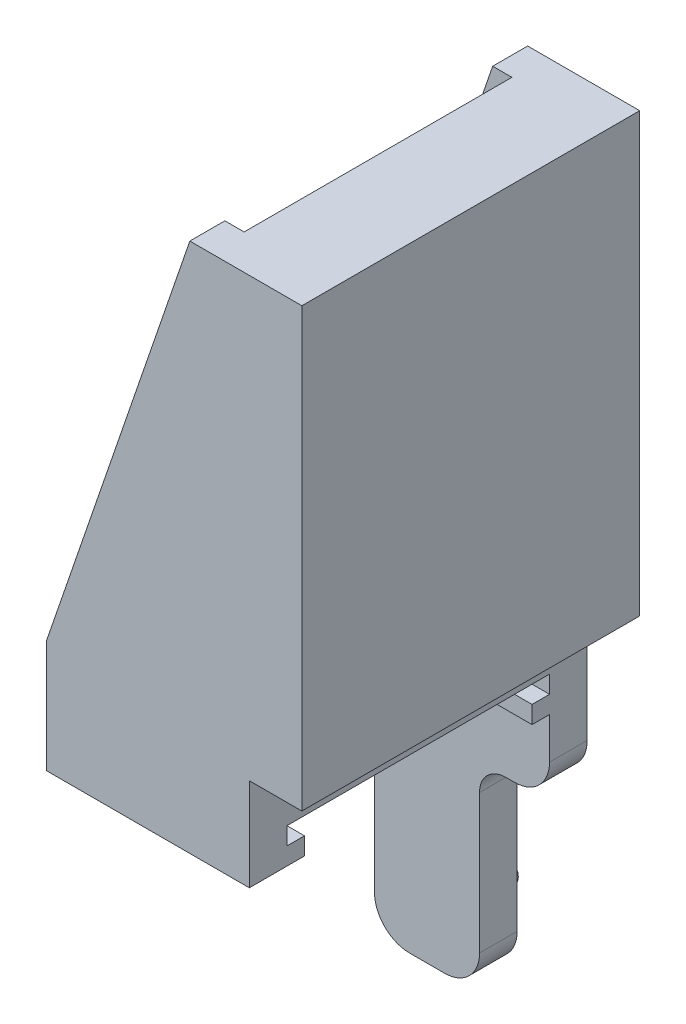
ISO-10303-21;
HEADER;
FILE_DESCRIPTION(('STEP AP214'),'2;1');
FILE_NAME('part.step','',(''),(''),'','','');
FILE_SCHEMA(('AUTOMOTIVE_DESIGN { 1 0 10303 214 1 1 1 1 }'));
ENDSEC;
DATA;
#1=APPLICATION_CONTEXT('core data for automotive mechanical design processes');
#2=APPLICATION_PROTOCOL_DEFINITION('international standard','automotive_design',2000,#1);
#3=PRODUCT_CONTEXT('',#1,'mechanical');
#4=PRODUCT('Part','Part','',(#3));
#5=PRODUCT_RELATED_PRODUCT_CATEGORY('part','',(#4));
#6=PRODUCT_DEFINITION_FORMATION('','',#4);
#7=PRODUCT_DEFINITION_CONTEXT('part definition',#1,'design');
#8=PRODUCT_DEFINITION('design','',#6,#7);
#9=PRODUCT_DEFINITION_SHAPE('','',#8);
#10=(LENGTH_UNIT() NAMED_UNIT(*) SI_UNIT(.MILLI.,.METRE.));
#11=(NAMED_UNIT(*) PLANE_ANGLE_UNIT() SI_UNIT($,.RADIAN.));
#12=(NAMED_UNIT(*) SI_UNIT($,.STERADIAN.) SOLID_ANGLE_UNIT());
#13=UNCERTAINTY_MEASURE_WITH_UNIT(LENGTH_MEASURE(1.E-05),#10,'distance_accuracy_value','');
#14=(GEOMETRIC_REPRESENTATION_CONTEXT(3) GLOBAL_UNCERTAINTY_ASSIGNED_CONTEXT((#13)) GLOBAL_UNIT_ASSIGNED_CONTEXT((#10,
#11,#12)) REPRESENTATION_CONTEXT('',''));
#15=CARTESIAN_POINT('',(0.,0.,0.));
#16=DIRECTION('',(0.,0.,1.));
#17=DIRECTION('',(1.,0.,0.));
#18=AXIS2_PLACEMENT_3D('',#15,#16,#17);
#19=CARTESIAN_POINT('',(5.79999999999999,-9.60695568829756,19.3));
#20=DIRECTION('',(-1.,0.,0.));
#21=DIRECTION('',(0.,0.,1.));
#22=AXIS2_PLACEMENT_3D('',#19,#20,#21);
#23=PLANE('',#22);
#24=DIRECTION('',(0.,0.,-1.));
#25=VECTOR('',#24,1.);
#26=CARTESIAN_POINT('',(5.79999999999999,-1.95,19.3));
#27=LINE('',#26,#25);
#28=CARTESIAN_POINT('',(5.79999999999999,-1.95,19.3));
#29=VERTEX_POINT('',#28);
#30=CARTESIAN_POINT('',(5.79999999999999,-1.95,0.));
#31=VERTEX_POINT('',#30);
#32=EDGE_CURVE('E262',#29,#31,#27,.T.);
#33=ORIENTED_EDGE('',*,*,#32,.F.);
#34=DIRECTION('',(0.,1.,0.));
#35=VECTOR('',#34,1.);
#36=CARTESIAN_POINT('',(5.79999999999999,-9.60695568829756,19.3));
#37=LINE('',#36,#35);
#38=CARTESIAN_POINT('',(5.79999999999999,-7.25000000000002,19.3));
#39=VERTEX_POINT('',#38);
#40=EDGE_CURVE('E267',#39,#29,#37,.T.);
#41=ORIENTED_EDGE('',*,*,#40,.F.);
#42=DIRECTION('',(0.,0.,-1.));
#43=VECTOR('',#42,1.);
#44=CARTESIAN_POINT('',(5.79999999999999,-7.25000000000003,19.3));
#45=LINE('',#44,#43);
#46=CARTESIAN_POINT('',(5.79999999999999,-7.25000000000002,16.15));
#47=VERTEX_POINT('',#46);
#48=EDGE_CURVE('E47',#39,#47,#45,.T.);
#49=ORIENTED_EDGE('',*,*,#48,.T.);
#50=DIRECTION('',(0.,1.,0.));
#51=VECTOR('',#50,1.);
#52=CARTESIAN_POINT('',(5.79999999999999,-9.60695568829756,16.15));
#53=LINE('',#52,#51);
#54=CARTESIAN_POINT('',(5.79999999999999,-6.25000000000002,16.15));
#55=VERTEX_POINT('',#54);
#56=EDGE_CURVE('E368',#47,#55,#53,.T.);
#57=ORIENTED_EDGE('',*,*,#56,.T.);
#58=DIRECTION('',(0.,0.,1.));
#59=VECTOR('',#58,1.);
#60=CARTESIAN_POINT('',(5.79999999999999,-6.25000000000003,19.3));
#61=LINE('',#60,#59);
#62=CARTESIAN_POINT('',(5.79999999999999,-6.25000000000002,17.15));
#63=VERTEX_POINT('',#62);
#64=EDGE_CURVE('E371',#55,#63,#61,.T.);
#65=ORIENTED_EDGE('',*,*,#64,.T.);
#66=DIRECTION('',(0.,1.,0.));
#67=VECTOR('',#66,1.);
#68=CARTESIAN_POINT('',(5.79999999999999,-9.60695568829757,17.15));
#69=LINE('',#68,#67);
#70=CARTESIAN_POINT('',(5.79999999999999,-5.25000000000002,17.15));
#71=VERTEX_POINT('',#70);
#72=EDGE_CURVE('E374',#63,#71,#69,.T.);
#73=ORIENTED_EDGE('',*,*,#72,.T.);
#74=DIRECTION('',(0.,0.,-1.));
#75=VECTOR('',#74,1.);
#76=CARTESIAN_POINT('',(5.79999999999999,-5.25000000000002,19.3));
#77=LINE('',#76,#75);
#78=CARTESIAN_POINT('',(5.79999999999999,-5.25000000000003,2.15));
#79=VERTEX_POINT('',#78);
#80=EDGE_CURVE('E377',#71,#79,#77,.T.);
#81=ORIENTED_EDGE('',*,*,#80,.T.);
#82=DIRECTION('',(0.,-1.,0.));
#83=VECTOR('',#82,1.);
#84=CARTESIAN_POINT('',(5.79999999999999,-9.60695568829757,2.15));
#85=LINE('',#84,#83);
#86=CARTESIAN_POINT('',(5.79999999999999,-6.25000000000003,2.15));
#87=VERTEX_POINT('',#86);
#88=EDGE_CURVE('E356',#79,#87,#85,.T.);
#89=ORIENTED_EDGE('',*,*,#88,.T.);
#90=DIRECTION('',(0.,0.,1.));
#91=VECTOR('',#90,1.);
#92=CARTESIAN_POINT('',(5.79999999999999,-6.25000000000002,19.3));
#93=LINE('',#92,#91);
#94=CARTESIAN_POINT('',(5.79999999999999,-6.25000000000003,3.15));
#95=VERTEX_POINT('',#94);
#96=EDGE_CURVE('E359',#87,#95,#93,.T.);
#97=ORIENTED_EDGE('',*,*,#96,.T.);
#98=DIRECTION('',(0.,-1.,0.));
#99=VECTOR('',#98,1.);
#100=CARTESIAN_POINT('',(5.79999999999999,-9.60695568829756,3.15));
#101=LINE('',#100,#99);
#102=CARTESIAN_POINT('',(5.79999999999999,-7.25000000000003,3.15));
#103=VERTEX_POINT('',#102);
#104=EDGE_CURVE('E362',#95,#103,#101,.T.);
#105=ORIENTED_EDGE('',*,*,#104,.T.);
#106=DIRECTION('',(0.,0.,-1.));
#107=VECTOR('',#106,1.);
#108=CARTESIAN_POINT('',(5.79999999999999,-7.25000000000003,19.3));
#109=LINE('',#108,#107);
#110=CARTESIAN_POINT('',(5.79999999999999,-7.25000000000003,2.15));
#111=VERTEX_POINT('',#110);
#112=EDGE_CURVE('E365',#103,#111,#109,.T.);
#113=ORIENTED_EDGE('',*,*,#112,.T.);
#114=DIRECTION('',(0.,-1.,0.));
#115=VECTOR('',#114,1.);
#116=CARTESIAN_POINT('',(5.79999999999999,-9.60695568829756,2.15));
#117=LINE('',#116,#115);
#118=CARTESIAN_POINT('',(5.79999999999999,-9.60695568829756,2.15));
#119=VERTEX_POINT('',#118);
#120=EDGE_CURVE('E353',#111,#119,#117,.T.);
#121=ORIENTED_EDGE('',*,*,#120,.T.);
#122=DIRECTION('',(0.,0.,-1.));
#123=VECTOR('',#122,1.);
#124=CARTESIAN_POINT('',(5.79999999999999,-9.60695568829756,19.3));
#125=LINE('',#124,#123);
#126=CARTESIAN_POINT('',(5.79999999999999,-9.60695568829756,0.));
#127=VERTEX_POINT('',#126);
#128=EDGE_CURVE('E492',#119,#127,#125,.T.);
#129=ORIENTED_EDGE('',*,*,#128,.T.);
#130=DIRECTION('',(0.,1.,0.));
#131=VECTOR('',#130,1.);
#132=CARTESIAN_POINT('',(5.79999999999999,-9.60695568829756,0.));
#133=LINE('',#132,#131);
#134=EDGE_CURVE('E422',#127,#31,#133,.T.);
#135=ORIENTED_EDGE('',*,*,#134,.T.);
#136=EDGE_LOOP('',(#33,#41,#49,#57,#65,#73,#81,#89,#97,#105,#113,#121,#129,#135));
#137=FACE_BOUND('',#136,.T.);
#138=ADVANCED_FACE('F32',(#137),#23,.F.);
#139=CARTESIAN_POINT('',(3.79999999999999,-9.60695568829757,0.));
#140=DIRECTION('',(0.,0.,1.));
#141=DIRECTION('',(1.,0.,0.));
#142=AXIS2_PLACEMENT_3D('',#139,#140,#141);
#143=PLANE('',#142);
#144=CARTESIAN_POINT('',(3.79999999999999,-9.60695568829757,0.));
#145=DIRECTION('',(0.,0.,1.));
#146=DIRECTION('',(1.,0.,0.));
#147=AXIS2_PLACEMENT_3D('',#144,#145,#146);
#148=CIRCLE('',#147,2.);
#149=CARTESIAN_POINT('',(3.79999999999998,-11.6069556882976,0.));
#150=VERTEX_POINT('',#149);
#151=EDGE_CURVE('E409',#150,#127,#148,.T.);
#152=ORIENTED_EDGE('',*,*,#151,.F.);
#153=DIRECTION('',(1.,0.,0.));
#154=VECTOR('',#153,1.);
#155=CARTESIAN_POINT('',(3.3,-11.6069556882976,0.));
#156=LINE('',#155,#154);
#157=CARTESIAN_POINT('',(3.3,-11.6069556882976,0.));
#158=VERTEX_POINT('',#157);
#159=EDGE_CURVE('E412',#158,#150,#156,.T.);
#160=ORIENTED_EDGE('',*,*,#159,.F.);
#161=CARTESIAN_POINT('',(3.29999999999999,-13.1069556882976,0.));
#162=DIRECTION('',(0.,0.,-1.));
#163=DIRECTION('',(-1.,0.,0.));
#164=AXIS2_PLACEMENT_3D('',#161,#162,#163);
#165=CIRCLE('',#164,1.5);
#166=CARTESIAN_POINT('',(1.79999999999999,-13.1069556882976,0.));
#167=VERTEX_POINT('',#166);
#168=EDGE_CURVE('E458',#167,#158,#165,.T.);
#169=ORIENTED_EDGE('',*,*,#168,.F.);
#170=DIRECTION('',(0.,1.,0.));
#171=VECTOR('',#170,1.);
#172=CARTESIAN_POINT('',(1.79999999999999,-13.1069556882976,0.));
#173=LINE('',#172,#171);
#174=CARTESIAN_POINT('',(1.79999999999999,-21.05,0.));
#175=VERTEX_POINT('',#174);
#176=EDGE_CURVE('E455',#175,#167,#173,.T.);
#177=ORIENTED_EDGE('',*,*,#176,.F.);
#178=CARTESIAN_POINT('',(-0.200000000000008,-21.05,0.));
#179=DIRECTION('',(0.,0.,1.));
#180=DIRECTION('',(-1.,0.,0.));
#181=AXIS2_PLACEMENT_3D('',#178,#179,#180);
#182=CIRCLE('',#181,2.);
#183=CARTESIAN_POINT('',(-0.200000000000022,-23.05,0.));
#184=VERTEX_POINT('',#183);
#185=EDGE_CURVE('E452',#184,#175,#182,.T.);
#186=ORIENTED_EDGE('',*,*,#185,.F.);
#187=DIRECTION('',(1.,0.,0.));
#188=VECTOR('',#187,1.);
#189=CARTESIAN_POINT('',(-0.200000000000023,-23.05,0.));
#190=LINE('',#189,#188);
#191=CARTESIAN_POINT('',(-2.19999999999999,-23.05,0.));
#192=VERTEX_POINT('',#191);
#193=EDGE_CURVE('E449',#192,#184,#190,.T.);
#194=ORIENTED_EDGE('',*,*,#193,.F.);
#195=CARTESIAN_POINT('',(-2.20000000000001,-21.05,0.));
#196=DIRECTION('',(0.,0.,1.));
#197=DIRECTION('',(-1.,0.,0.));
#198=AXIS2_PLACEMENT_3D('',#195,#196,#197);
#199=CIRCLE('',#198,2.);
#200=CARTESIAN_POINT('',(-4.20000000000001,-21.05,0.));
#201=VERTEX_POINT('',#200);
#202=EDGE_CURVE('E446',#201,#192,#199,.T.);
#203=ORIENTED_EDGE('',*,*,#202,.F.);
#204=DIRECTION('',(0.,-1.,0.));
#205=VECTOR('',#204,1.);
#206=CARTESIAN_POINT('',(-4.20000000000001,-21.05,0.));
#207=LINE('',#206,#205);
#208=CARTESIAN_POINT('',(-4.20000000000001,-12.1092881557783,0.));
#209=VERTEX_POINT('',#208);
#210=EDGE_CURVE('E443',#209,#201,#207,.T.);
#211=ORIENTED_EDGE('',*,*,#210,.F.);
#212=CARTESIAN_POINT('',(-4.70000000000001,-12.1092881557783,0.));
#213=DIRECTION('',(0.,0.,-1.));
#214=DIRECTION('',(1.,0.,0.));
#215=AXIS2_PLACEMENT_3D('',#212,#213,#214);
#216=CIRCLE('',#215,0.499999999999999);
#217=CARTESIAN_POINT('',(-4.70232702713509,-11.6092935708629,0.));
#218=VERTEX_POINT('',#217);
#219=EDGE_CURVE('E440',#218,#209,#216,.T.);
#220=ORIENTED_EDGE('',*,*,#219,.F.);
#221=DIRECTION('',(0.999989169830779,0.00465405427015842,0.));
#222=VECTOR('',#221,1.);
#223=CARTESIAN_POINT('',(-4.70232702713509,-11.6092935708629,0.));
#224=LINE('',#223,#222);
#225=CARTESIAN_POINT('',(-4.79534594572987,-11.6097264906468,0.));
#226=VERTEX_POINT('',#225);
#227=EDGE_CURVE('E437',#226,#218,#224,.T.);
#228=ORIENTED_EDGE('',*,*,#227,.F.);
#229=CARTESIAN_POINT('',(-4.80000000000001,-10.609737320816,0.));
#230=DIRECTION('',(0.,0.,1.));
#231=DIRECTION('',(-1.,0.,0.));
#232=AXIS2_PLACEMENT_3D('',#229,#230,#231);
#233=CIRCLE('',#232,1.00000000000001);
#234=CARTESIAN_POINT('',(-5.80000000000002,-10.609737320816,0.));
#235=VERTEX_POINT('',#234);
#236=EDGE_CURVE('E434',#235,#226,#233,.T.);
#237=ORIENTED_EDGE('',*,*,#236,.F.);
#238=DIRECTION('',(0.,-1.,0.));
#239=VECTOR('',#238,1.);
#240=CARTESIAN_POINT('',(-5.80000000000003,-10.609737320816,0.));
#241=LINE('',#240,#239);
#242=CARTESIAN_POINT('',(-5.80000000000001,-0.850000000000011,0.));
#243=VERTEX_POINT('',#242);
#244=EDGE_CURVE('E431',#243,#235,#241,.T.);
#245=ORIENTED_EDGE('',*,*,#244,.F.);
#246=DIRECTION('',(-0.324526679920324,-0.945876542694601,0.));
#247=VECTOR('',#246,1.);
#248=CARTESIAN_POINT('',(2.4,23.05,0.));
#249=LINE('',#248,#247);
#250=CARTESIAN_POINT('',(2.4,23.05,0.));
#251=VERTEX_POINT('',#250);
#252=EDGE_CURVE('E428',#251,#243,#249,.T.);
#253=ORIENTED_EDGE('',*,*,#252,.F.);
#254=DIRECTION('',(-1.,0.,0.));
#255=VECTOR('',#254,1.);
#256=CARTESIAN_POINT('',(5.79999999999999,23.05,0.));
#257=LINE('',#256,#255);
#258=CARTESIAN_POINT('',(8.79999999999999,23.05,0.));
#259=VERTEX_POINT('',#258);
#260=EDGE_CURVE('E425',#259,#251,#257,.T.);
#261=ORIENTED_EDGE('',*,*,#260,.F.);
#262=DIRECTION('',(0.,1.,0.));
#263=VECTOR('',#262,1.);
#264=CARTESIAN_POINT('',(8.79999999999999,23.05,0.));
#265=LINE('',#264,#263);
#266=CARTESIAN_POINT('',(8.79999999999999,-1.95,0.));
#267=VERTEX_POINT('',#266);
#268=EDGE_CURVE('E253',#267,#259,#265,.T.);
#269=ORIENTED_EDGE('',*,*,#268,.F.);
#270=DIRECTION('',(-1.,0.,0.));
#271=VECTOR('',#270,1.);
#272=CARTESIAN_POINT('',(8.79999999999999,-1.95,0.));
#273=LINE('',#272,#271);
#274=EDGE_CURVE('E249',#267,#31,#273,.T.);
#275=ORIENTED_EDGE('',*,*,#274,.T.);
#276=ORIENTED_EDGE('',*,*,#134,.F.);
#277=EDGE_LOOP('',(#152,#160,#169,#177,#186,#194,#203,#211,#220,#228,#237,#245,#253,#261,#269,
#275,#276));
#278=FACE_BOUND('',#277,.T.);
#279=CARTESIAN_POINT('',(-0.885806676644892,-20.3182060058344,0.));
#280=DIRECTION('',(0.,0.,1.));
#281=DIRECTION('',(1.,0.,0.));
#282=AXIS2_PLACEMENT_3D('',#279,#280,#281);
#283=CIRCLE('',#282,0.750000000000002);
#284=CARTESIAN_POINT('',(-0.135806676644891,-20.3182060058344,0.));
#285=VERTEX_POINT('',#284);
#286=EDGE_CURVE('E11',#285,#285,#283,.F.);
#287=ORIENTED_EDGE('',*,*,#286,.F.);
#288=EDGE_LOOP('',(#287));
#289=FACE_BOUND('',#288,.T.);
#290=ADVANCED_FACE('F512',(#278,#289),#143,.F.);
#291=CARTESIAN_POINT('',(2.4,23.05,19.3));
#292=DIRECTION('',(0.945876542694601,-0.324526679920324,0.));
#293=DIRECTION('',(0.324526679920324,0.945876542694601,0.));
#294=AXIS2_PLACEMENT_3D('',#291,#292,#293);
#295=PLANE('',#294);
#296=DIRECTION('',(0.,0.,-1.));
#297=VECTOR('',#296,1.);
#298=CARTESIAN_POINT('',(-5.80000000000001,-0.850000000000011,19.3));
#299=LINE('',#298,#297);
#300=CARTESIAN_POINT('',(-5.8,-0.850000000000011,2.));
#301=VERTEX_POINT('',#300);
#302=EDGE_CURVE('E484',#301,#243,#299,.T.);
#303=ORIENTED_EDGE('',*,*,#302,.F.);
#304=DIRECTION('',(0.324526679920324,0.945876542694601,0.));
#305=VECTOR('',#304,1.);
#306=CARTESIAN_POINT('',(2.4,23.05,2.));
#307=LINE('',#306,#305);
#308=CARTESIAN_POINT('',(2.4,23.05,2.));
#309=VERTEX_POINT('',#308);
#310=EDGE_CURVE('E406',#301,#309,#307,.T.);
#311=ORIENTED_EDGE('',*,*,#310,.T.);
#312=DIRECTION('',(0.,0.,-1.));
#313=VECTOR('',#312,1.);
#314=CARTESIAN_POINT('',(2.4,23.05,19.3));
#315=LINE('',#314,#313);
#316=EDGE_CURVE('E488',#309,#251,#315,.T.);
#317=ORIENTED_EDGE('',*,*,#316,.T.);
#318=ORIENTED_EDGE('',*,*,#252,.T.);
#319=EDGE_LOOP('',(#303,#311,#317,#318));
#320=FACE_BOUND('',#319,.T.);
#321=ADVANCED_FACE('F568',(#320),#295,.F.);
#322=CARTESIAN_POINT('',(3.79999999999999,-9.60695568829757,19.3));
#323=DIRECTION('',(0.,0.,-1.));
#324=DIRECTION('',(-1.,0.,0.));
#325=AXIS2_PLACEMENT_3D('',#322,#323,#324);
#326=CYLINDRICAL_SURFACE('',#325,2.);
#327=ORIENTED_EDGE('',*,*,#128,.F.);
#328=CARTESIAN_POINT('',(3.79999999999999,-9.60695568829757,2.15));
#329=DIRECTION('',(0.,0.,-1.));
#330=DIRECTION('',(-1.,0.,0.));
#331=AXIS2_PLACEMENT_3D('',#328,#329,#330);
#332=CIRCLE('',#331,2.);
#333=CARTESIAN_POINT('',(3.79999999999998,-11.6069556882976,2.15));
#334=VERTEX_POINT('',#333);
#335=EDGE_CURVE('E350',#119,#334,#332,.T.);
#336=ORIENTED_EDGE('',*,*,#335,.T.);
#337=DIRECTION('',(0.,0.,-1.));
#338=VECTOR('',#337,1.);
#339=CARTESIAN_POINT('',(3.79999999999998,-11.6069556882976,19.3));
#340=LINE('',#339,#338);
#341=EDGE_CURVE('E419',#334,#150,#340,.T.);
#342=ORIENTED_EDGE('',*,*,#341,.T.);
#343=ORIENTED_EDGE('',*,*,#151,.T.);
#344=EDGE_LOOP('',(#327,#336,#342,#343));
#345=FACE_BOUND('',#344,.T.);
#346=ADVANCED_FACE('F34',(#345),#326,.T.);
#347=CARTESIAN_POINT('',(5.79999999999999,23.05,19.3));
#348=DIRECTION('',(0.,-1.,0.));
#349=DIRECTION('',(1.,0.,0.));
#350=AXIS2_PLACEMENT_3D('',#347,#348,#349);
#351=PLANE('',#350);
#352=ORIENTED_EDGE('',*,*,#316,.F.);
#353=DIRECTION('',(-1.,0.,0.));
#354=VECTOR('',#353,1.);
#355=CARTESIAN_POINT('',(3.5,23.05,2.));
#356=LINE('',#355,#354);
#357=CARTESIAN_POINT('',(3.5,23.05,2.));
#358=VERTEX_POINT('',#357);
#359=EDGE_CURVE('E398',#358,#309,#356,.T.);
#360=ORIENTED_EDGE('',*,*,#359,.F.);
#361=DIRECTION('',(0.,0.,-1.));
#362=VECTOR('',#361,1.);
#363=CARTESIAN_POINT('',(3.5,23.05,17.3));
#364=LINE('',#363,#362);
#365=CARTESIAN_POINT('',(3.5,23.05,17.3));
#366=VERTEX_POINT('',#365);
#367=EDGE_CURVE('E387',#366,#358,#364,.T.);
#368=ORIENTED_EDGE('',*,*,#367,.F.);
#369=DIRECTION('',(-1.,0.,0.));
#370=VECTOR('',#369,1.);
#371=CARTESIAN_POINT('',(3.5,23.05,17.3));
#372=LINE('',#371,#370);
#373=CARTESIAN_POINT('',(2.4,23.05,17.3));
#374=VERTEX_POINT('',#373);
#375=EDGE_CURVE('E400',#366,#374,#372,.T.);
#376=ORIENTED_EDGE('',*,*,#375,.T.);
#377=CARTESIAN_POINT('',(2.4,23.05,19.3));
#378=VERTEX_POINT('',#377);
#379=EDGE_CURVE('E489',#378,#374,#315,.T.);
#380=ORIENTED_EDGE('',*,*,#379,.F.);
#381=DIRECTION('',(-1.,0.,0.));
#382=VECTOR('',#381,1.);
#383=CARTESIAN_POINT('',(5.79999999999999,23.05,19.3));
#384=LINE('',#383,#382);
#385=CARTESIAN_POINT('',(8.79999999999999,23.05,19.3));
#386=VERTEX_POINT('',#385);
#387=EDGE_CURVE('E411',#386,#378,#384,.T.);
#388=ORIENTED_EDGE('',*,*,#387,.F.);
#389=DIRECTION('',(0.,0.,1.));
#390=VECTOR('',#389,1.);
#391=CARTESIAN_POINT('',(8.79999999999999,23.05,19.3));
#392=LINE('',#391,#390);
#393=EDGE_CURVE('E260',#259,#386,#392,.T.);
#394=ORIENTED_EDGE('',*,*,#393,.F.);
#395=ORIENTED_EDGE('',*,*,#260,.T.);
#396=EDGE_LOOP('',(#352,#360,#368,#376,#380,#388,#394,#395));
#397=FACE_BOUND('',#396,.T.);
#398=ADVANCED_FACE('F572',(#397),#351,.F.);
#399=ORIENTED_EDGE('',*,*,#379,.T.);
#400=DIRECTION('',(-0.324526679920324,-0.945876542694601,0.));
#401=VECTOR('',#400,1.);
#402=CARTESIAN_POINT('',(2.4,23.05,17.3));
#403=LINE('',#402,#401);
#404=CARTESIAN_POINT('',(-5.8,-0.850000000000011,17.3));
#405=VERTEX_POINT('',#404);
#406=EDGE_CURVE('E397',#374,#405,#403,.T.);
#407=ORIENTED_EDGE('',*,*,#406,.T.);
#408=CARTESIAN_POINT('',(-5.80000000000001,-0.850000000000011,19.3));
#409=VERTEX_POINT('',#408);
#410=EDGE_CURVE('E485',#409,#405,#299,.T.);
#411=ORIENTED_EDGE('',*,*,#410,.F.);
#412=DIRECTION('',(-0.324526679920324,-0.945876542694601,0.));
#413=VECTOR('',#412,1.);
#414=CARTESIAN_POINT('',(2.4,23.05,19.3));
#415=LINE('',#414,#413);
#416=EDGE_CURVE('E414',#378,#409,#415,.T.);
#417=ORIENTED_EDGE('',*,*,#416,.F.);
#418=EDGE_LOOP('',(#399,#407,#411,#417));
#419=FACE_BOUND('',#418,.T.);
#420=ADVANCED_FACE('F615',(#419),#295,.F.);
#421=CARTESIAN_POINT('',(-5.80000000000003,-10.609737320816,19.3));
#422=DIRECTION('',(1.,0.,0.));
#423=DIRECTION('',(0.,1.,0.));
#424=AXIS2_PLACEMENT_3D('',#421,#422,#423);
#425=PLANE('',#424);
#426=DIRECTION('',(0.,1.,0.));
#427=VECTOR('',#426,1.);
#428=CARTESIAN_POINT('',(-5.80000000000002,-6.24999999999999,16.15));
#429=LINE('',#428,#427);
#430=CARTESIAN_POINT('',(-5.80000000000002,-7.24999999999999,16.15));
#431=VERTEX_POINT('',#430);
#432=CARTESIAN_POINT('',(-5.80000000000002,-6.24999999999999,16.15));
#433=VERTEX_POINT('',#432);
#434=EDGE_CURVE('E295',#431,#433,#429,.T.);
#435=ORIENTED_EDGE('',*,*,#434,.F.);
#436=DIRECTION('',(0.,0.,-1.));
#437=VECTOR('',#436,1.);
#438=CARTESIAN_POINT('',(-5.80000000000002,-7.24999999999999,16.15));
#439=LINE('',#438,#437);
#440=CARTESIAN_POINT('',(-5.80000000000002,-7.25,19.3));
#441=VERTEX_POINT('',#440);
#442=EDGE_CURVE('E292',#441,#431,#439,.T.);
#443=ORIENTED_EDGE('',*,*,#442,.F.);
#444=DIRECTION('',(0.,-1.,0.));
#445=VECTOR('',#444,1.);
#446=CARTESIAN_POINT('',(-5.80000000000003,-10.609737320816,19.3));
#447=LINE('',#446,#445);
#448=EDGE_CURVE('E416',#409,#441,#447,.T.);
#449=ORIENTED_EDGE('',*,*,#448,.F.);
#450=ORIENTED_EDGE('',*,*,#410,.T.);
#451=DIRECTION('',(0.,1.,0.));
#452=VECTOR('',#451,1.);
#453=CARTESIAN_POINT('',(-5.8,-3.25,17.3));
#454=LINE('',#453,#452);
#455=CARTESIAN_POINT('',(-5.80000000000001,-3.25,17.3));
#456=VERTEX_POINT('',#455);
#457=EDGE_CURVE('E384',#456,#405,#454,.T.);
#458=ORIENTED_EDGE('',*,*,#457,.F.);
#459=DIRECTION('',(0.,0.,1.));
#460=VECTOR('',#459,1.);
#461=CARTESIAN_POINT('',(-5.8,-3.25,2.));
#462=LINE('',#461,#460);
#463=CARTESIAN_POINT('',(-5.8,-3.25,2.));
#464=VERTEX_POINT('',#463);
#465=EDGE_CURVE('E55',#464,#456,#462,.T.);
#466=ORIENTED_EDGE('',*,*,#465,.F.);
#467=DIRECTION('',(0.,1.,0.));
#468=VECTOR('',#467,1.);
#469=CARTESIAN_POINT('',(-5.80000000000003,-10.609737320816,2.));
#470=LINE('',#469,#468);
#471=EDGE_CURVE('E494',#464,#301,#470,.T.);
#472=ORIENTED_EDGE('',*,*,#471,.T.);
#473=ORIENTED_EDGE('',*,*,#302,.T.);
#474=ORIENTED_EDGE('',*,*,#244,.T.);
#475=DIRECTION('',(0.,0.,-1.));
#476=VECTOR('',#475,1.);
#477=CARTESIAN_POINT('',(-5.80000000000002,-10.609737320816,19.3));
#478=LINE('',#477,#476);
#479=CARTESIAN_POINT('',(-5.80000000000003,-10.609737320816,2.15));
#480=VERTEX_POINT('',#479);
#481=EDGE_CURVE('E482',#480,#235,#478,.T.);
#482=ORIENTED_EDGE('',*,*,#481,.F.);
#483=DIRECTION('',(0.,-1.,0.));
#484=VECTOR('',#483,1.);
#485=CARTESIAN_POINT('',(-5.80000000000002,-7.25,2.15));
#486=LINE('',#485,#484);
#487=CARTESIAN_POINT('',(-5.80000000000002,-7.25,2.15));
#488=VERTEX_POINT('',#487);
#489=EDGE_CURVE('E290',#488,#480,#486,.T.);
#490=ORIENTED_EDGE('',*,*,#489,.F.);
#491=DIRECTION('',(0.,0.,-1.));
#492=VECTOR('',#491,1.);
#493=CARTESIAN_POINT('',(-5.80000000000002,-7.25,3.15));
#494=LINE('',#493,#492);
#495=CARTESIAN_POINT('',(-5.80000000000002,-7.25,3.15));
#496=VERTEX_POINT('',#495);
#497=EDGE_CURVE('E287',#496,#488,#494,.T.);
#498=ORIENTED_EDGE('',*,*,#497,.F.);
#499=DIRECTION('',(0.,-1.,0.));
#500=VECTOR('',#499,1.);
#501=CARTESIAN_POINT('',(-5.80000000000002,-6.25,3.15));
#502=LINE('',#501,#500);
#503=CARTESIAN_POINT('',(-5.80000000000002,-6.25,3.15));
#504=VERTEX_POINT('',#503);
#505=EDGE_CURVE('E284',#504,#496,#502,.T.);
#506=ORIENTED_EDGE('',*,*,#505,.F.);
#507=DIRECTION('',(0.,0.,1.));
#508=VECTOR('',#507,1.);
#509=CARTESIAN_POINT('',(-5.80000000000002,-6.25,2.15));
#510=LINE('',#509,#508);
#511=CARTESIAN_POINT('',(-5.80000000000002,-6.25,2.15));
#512=VERTEX_POINT('',#511);
#513=EDGE_CURVE('E281',#512,#504,#510,.T.);
#514=ORIENTED_EDGE('',*,*,#513,.F.);
#515=DIRECTION('',(0.,-1.,0.));
#516=VECTOR('',#515,1.);
#517=CARTESIAN_POINT('',(-5.80000000000002,-5.25,2.15));
#518=LINE('',#517,#516);
#519=CARTESIAN_POINT('',(-5.80000000000002,-5.25,2.15));
#520=VERTEX_POINT('',#519);
#521=EDGE_CURVE('E278',#520,#512,#518,.T.);
#522=ORIENTED_EDGE('',*,*,#521,.F.);
#523=DIRECTION('',(0.,0.,-1.));
#524=VECTOR('',#523,1.);
#525=CARTESIAN_POINT('',(-5.80000000000002,-5.25,17.15));
#526=LINE('',#525,#524);
#527=CARTESIAN_POINT('',(-5.80000000000002,-5.25,17.15));
#528=VERTEX_POINT('',#527);
#529=EDGE_CURVE('E271',#528,#520,#526,.T.);
#530=ORIENTED_EDGE('',*,*,#529,.F.);
#531=DIRECTION('',(0.,1.,0.));
#532=VECTOR('',#531,1.);
#533=CARTESIAN_POINT('',(-5.80000000000002,-5.25,17.15));
#534=LINE('',#533,#532);
#535=CARTESIAN_POINT('',(-5.80000000000002,-6.25,17.15));
#536=VERTEX_POINT('',#535);
#537=EDGE_CURVE('E301',#536,#528,#534,.T.);
#538=ORIENTED_EDGE('',*,*,#537,.F.);
#539=DIRECTION('',(0.,0.,1.));
#540=VECTOR('',#539,1.);
#541=CARTESIAN_POINT('',(-5.80000000000002,-6.25,17.15));
#542=LINE('',#541,#540);
#543=EDGE_CURVE('E298',#433,#536,#542,.T.);
#544=ORIENTED_EDGE('',*,*,#543,.F.);
#545=EDGE_LOOP('',(#435,#443,#449,#450,#458,#466,#472,#473,#474,#482,#490,#498,#506,#514,#522,
#530,#538,#544));
#546=FACE_BOUND('',#545,.T.);
#547=ADVANCED_FACE('F532',(#546),#425,.F.);
#548=CARTESIAN_POINT('',(-4.80000000000001,-10.609737320816,19.3));
#549=DIRECTION('',(0.,0.,-1.));
#550=DIRECTION('',(-1.,0.,0.));
#551=AXIS2_PLACEMENT_3D('',#548,#549,#550);
#552=CYLINDRICAL_SURFACE('',#551,1.00000000000001);
#553=DIRECTION('',(0.,0.,-1.));
#554=VECTOR('',#553,1.);
#555=CARTESIAN_POINT('',(-4.79534594572987,-11.6097264906468,19.3));
#556=LINE('',#555,#554);
#557=CARTESIAN_POINT('',(-4.79534594572987,-11.6097264906468,2.15));
#558=VERTEX_POINT('',#557);
#559=EDGE_CURVE('E480',#558,#226,#556,.T.);
#560=ORIENTED_EDGE('',*,*,#559,.F.);
#561=CARTESIAN_POINT('',(-4.80000000000001,-10.609737320816,2.15));
#562=DIRECTION('',(0.,0.,-1.));
#563=DIRECTION('',(-1.,0.,0.));
#564=AXIS2_PLACEMENT_3D('',#561,#562,#563);
#565=CIRCLE('',#564,1.00000000000001);
#566=EDGE_CURVE('E347',#558,#480,#565,.T.);
#567=ORIENTED_EDGE('',*,*,#566,.T.);
#568=ORIENTED_EDGE('',*,*,#481,.T.);
#569=ORIENTED_EDGE('',*,*,#236,.T.);
#570=EDGE_LOOP('',(#560,#567,#568,#569));
#571=FACE_BOUND('',#570,.T.);
#572=ADVANCED_FACE('F536',(#571),#552,.T.);
#573=CARTESIAN_POINT('',(-4.70232702713509,-11.6092935708629,19.3));
#574=DIRECTION('',(-0.00465405427015842,0.999989169830779,0.));
#575=DIRECTION('',(-0.999989169830779,-0.00465405427015842,0.));
#576=AXIS2_PLACEMENT_3D('',#573,#574,#575);
#577=PLANE('',#576);
#578=DIRECTION('',(0.,0.,-1.));
#579=VECTOR('',#578,1.);
#580=CARTESIAN_POINT('',(-4.70232702713509,-11.6092935708629,19.3));
#581=LINE('',#580,#579);
#582=CARTESIAN_POINT('',(-4.70232702713509,-11.6092935708629,2.15));
#583=VERTEX_POINT('',#582);
#584=EDGE_CURVE('E478',#583,#218,#581,.T.);
#585=ORIENTED_EDGE('',*,*,#584,.F.);
#586=DIRECTION('',(-0.999989169830779,-0.00465405427015842,0.));
#587=VECTOR('',#586,1.);
#588=CARTESIAN_POINT('',(-4.70232702713509,-11.6092935708629,2.15));
#589=LINE('',#588,#587);
#590=EDGE_CURVE('E344',#583,#558,#589,.T.);
#591=ORIENTED_EDGE('',*,*,#590,.T.);
#592=ORIENTED_EDGE('',*,*,#559,.T.);
#593=ORIENTED_EDGE('',*,*,#227,.T.);
#594=EDGE_LOOP('',(#585,#591,#592,#593));
#595=FACE_BOUND('',#594,.T.);
#596=ADVANCED_FACE('F541',(#595),#577,.F.);
#597=CARTESIAN_POINT('',(-4.70000000000001,-12.1092881557783,19.3));
#598=DIRECTION('',(0.,0.,-1.));
#599=DIRECTION('',(-1.,0.,0.));
#600=AXIS2_PLACEMENT_3D('',#597,#598,#599);
#601=CYLINDRICAL_SURFACE('',#600,0.499999999999999);
#602=DIRECTION('',(0.,0.,-1.));
#603=VECTOR('',#602,1.);
#604=CARTESIAN_POINT('',(-4.20000000000001,-12.1092881557783,19.3));
#605=LINE('',#604,#603);
#606=CARTESIAN_POINT('',(-4.20000000000001,-12.1092881557783,2.15));
#607=VERTEX_POINT('',#606);
#608=EDGE_CURVE('E476',#607,#209,#605,.T.);
#609=ORIENTED_EDGE('',*,*,#608,.F.);
#610=CARTESIAN_POINT('',(-4.70000000000001,-12.1092881557783,2.15));
#611=DIRECTION('',(0.,0.,-1.));
#612=DIRECTION('',(-1.,0.,0.));
#613=AXIS2_PLACEMENT_3D('',#610,#611,#612);
#614=CIRCLE('',#613,0.499999999999999);
#615=EDGE_CURVE('E341',#607,#583,#614,.F.);
#616=ORIENTED_EDGE('',*,*,#615,.T.);
#617=ORIENTED_EDGE('',*,*,#584,.T.);
#618=ORIENTED_EDGE('',*,*,#219,.T.);
#619=EDGE_LOOP('',(#609,#616,#617,#618));
#620=FACE_BOUND('',#619,.T.);
#621=ADVANCED_FACE('F545',(#620),#601,.F.);
#622=CARTESIAN_POINT('',(-4.20000000000001,-21.05,19.3));
#623=DIRECTION('',(1.,0.,0.));
#624=DIRECTION('',(0.,0.,-1.));
#625=AXIS2_PLACEMENT_3D('',#622,#623,#624);
#626=PLANE('',#625);
#627=DIRECTION('',(0.,0.,-1.));
#628=VECTOR('',#627,1.);
#629=CARTESIAN_POINT('',(-4.20000000000001,-21.05,19.3));
#630=LINE('',#629,#628);
#631=CARTESIAN_POINT('',(-4.20000000000001,-21.05,2.15));
#632=VERTEX_POINT('',#631);
#633=EDGE_CURVE('E474',#632,#201,#630,.T.);
#634=ORIENTED_EDGE('',*,*,#633,.F.);
#635=DIRECTION('',(0.,1.,0.));
#636=VECTOR('',#635,1.);
#637=CARTESIAN_POINT('',(-4.20000000000001,-21.05,2.15));
#638=LINE('',#637,#636);
#639=EDGE_CURVE('E338',#632,#607,#638,.T.);
#640=ORIENTED_EDGE('',*,*,#639,.T.);
#641=ORIENTED_EDGE('',*,*,#608,.T.);
#642=ORIENTED_EDGE('',*,*,#210,.T.);
#643=EDGE_LOOP('',(#634,#640,#641,#642));
#644=FACE_BOUND('',#643,.T.);
#645=ADVANCED_FACE('F549',(#644),#626,.F.);
#646=CARTESIAN_POINT('',(-2.20000000000001,-21.05,19.3));
#647=DIRECTION('',(0.,0.,-1.));
#648=DIRECTION('',(-1.,0.,0.));
#649=AXIS2_PLACEMENT_3D('',#646,#647,#648);
#650=CYLINDRICAL_SURFACE('',#649,2.);
#651=DIRECTION('',(0.,0.,-1.));
#652=VECTOR('',#651,1.);
#653=CARTESIAN_POINT('',(-2.19999999999999,-23.05,19.3));
#654=LINE('',#653,#652);
#655=CARTESIAN_POINT('',(-2.19999999999999,-23.05,2.15));
#656=VERTEX_POINT('',#655);
#657=EDGE_CURVE('E472',#656,#192,#654,.T.);
#658=ORIENTED_EDGE('',*,*,#657,.F.);
#659=CARTESIAN_POINT('',(-2.20000000000001,-21.05,2.15));
#660=DIRECTION('',(0.,0.,-1.));
#661=DIRECTION('',(-1.,0.,0.));
#662=AXIS2_PLACEMENT_3D('',#659,#660,#661);
#663=CIRCLE('',#662,2.);
#664=EDGE_CURVE('E335',#656,#632,#663,.T.);
#665=ORIENTED_EDGE('',*,*,#664,.T.);
#666=ORIENTED_EDGE('',*,*,#633,.T.);
#667=ORIENTED_EDGE('',*,*,#202,.T.);
#668=EDGE_LOOP('',(#658,#665,#666,#667));
#669=FACE_BOUND('',#668,.T.);
#670=ADVANCED_FACE('F553',(#669),#650,.T.);
#671=CARTESIAN_POINT('',(-0.200000000000023,-23.05,19.3));
#672=DIRECTION('',(0.,1.,0.));
#673=DIRECTION('',(0.,0.,1.));
#674=AXIS2_PLACEMENT_3D('',#671,#672,#673);
#675=PLANE('',#674);
#676=DIRECTION('',(0.,0.,-1.));
#677=VECTOR('',#676,1.);
#678=CARTESIAN_POINT('',(-0.200000000000022,-23.05,19.3));
#679=LINE('',#678,#677);
#680=CARTESIAN_POINT('',(-0.200000000000022,-23.05,2.15));
#681=VERTEX_POINT('',#680);
#682=EDGE_CURVE('E470',#681,#184,#679,.T.);
#683=ORIENTED_EDGE('',*,*,#682,.F.);
#684=DIRECTION('',(-1.,0.,0.));
#685=VECTOR('',#684,1.);
#686=CARTESIAN_POINT('',(-0.200000000000023,-23.05,2.15));
#687=LINE('',#686,#685);
#688=EDGE_CURVE('E332',#681,#656,#687,.T.);
#689=ORIENTED_EDGE('',*,*,#688,.T.);
#690=ORIENTED_EDGE('',*,*,#657,.T.);
#691=ORIENTED_EDGE('',*,*,#193,.T.);
#692=EDGE_LOOP('',(#683,#689,#690,#691));
#693=FACE_BOUND('',#692,.T.);
#694=ADVANCED_FACE('F557',(#693),#675,.F.);
#695=CARTESIAN_POINT('',(-0.200000000000008,-21.05,19.3));
#696=DIRECTION('',(0.,0.,-1.));
#697=DIRECTION('',(-1.,0.,0.));
#698=AXIS2_PLACEMENT_3D('',#695,#696,#697);
#699=CYLINDRICAL_SURFACE('',#698,2.);
#700=DIRECTION('',(0.,0.,-1.));
#701=VECTOR('',#700,1.);
#702=CARTESIAN_POINT('',(1.79999999999999,-21.05,19.3));
#703=LINE('',#702,#701);
#704=CARTESIAN_POINT('',(1.79999999999999,-21.05,2.15));
#705=VERTEX_POINT('',#704);
#706=EDGE_CURVE('E468',#705,#175,#703,.T.);
#707=ORIENTED_EDGE('',*,*,#706,.F.);
#708=CARTESIAN_POINT('',(-0.200000000000008,-21.05,2.15));
#709=DIRECTION('',(0.,0.,-1.));
#710=DIRECTION('',(-1.,0.,0.));
#711=AXIS2_PLACEMENT_3D('',#708,#709,#710);
#712=CIRCLE('',#711,2.);
#713=EDGE_CURVE('E329',#705,#681,#712,.T.);
#714=ORIENTED_EDGE('',*,*,#713,.T.);
#715=ORIENTED_EDGE('',*,*,#682,.T.);
#716=ORIENTED_EDGE('',*,*,#185,.T.);
#717=EDGE_LOOP('',(#707,#714,#715,#716));
#718=FACE_BOUND('',#717,.T.);
#719=ADVANCED_FACE('F561',(#718),#699,.T.);
#720=CARTESIAN_POINT('',(1.79999999999999,-13.1069556882976,19.3));
#721=DIRECTION('',(-1.,0.,0.));
#722=DIRECTION('',(0.,0.,1.));
#723=AXIS2_PLACEMENT_3D('',#720,#721,#722);
#724=PLANE('',#723);
#725=DIRECTION('',(0.,0.,-1.));
#726=VECTOR('',#725,1.);
#727=CARTESIAN_POINT('',(1.79999999999999,-13.1069556882976,19.3));
#728=LINE('',#727,#726);
#729=CARTESIAN_POINT('',(1.79999999999999,-13.1069556882976,2.15));
#730=VERTEX_POINT('',#729);
#731=EDGE_CURVE('E466',#730,#167,#728,.T.);
#732=ORIENTED_EDGE('',*,*,#731,.F.);
#733=DIRECTION('',(0.,-1.,0.));
#734=VECTOR('',#733,1.);
#735=CARTESIAN_POINT('',(1.79999999999999,-13.1069556882976,2.15));
#736=LINE('',#735,#734);
#737=EDGE_CURVE('E326',#730,#705,#736,.T.);
#738=ORIENTED_EDGE('',*,*,#737,.T.);
#739=ORIENTED_EDGE('',*,*,#706,.T.);
#740=ORIENTED_EDGE('',*,*,#176,.T.);
#741=EDGE_LOOP('',(#732,#738,#739,#740));
#742=FACE_BOUND('',#741,.T.);
#743=ADVANCED_FACE('F563',(#742),#724,.F.);
#744=CARTESIAN_POINT('',(3.29999999999999,-13.1069556882976,19.3));
#745=DIRECTION('',(0.,0.,-1.));
#746=DIRECTION('',(-1.,0.,0.));
#747=AXIS2_PLACEMENT_3D('',#744,#745,#746);
#748=CYLINDRICAL_SURFACE('',#747,1.5);
#749=DIRECTION('',(0.,0.,-1.));
#750=VECTOR('',#749,1.);
#751=CARTESIAN_POINT('',(3.3,-11.6069556882976,19.3));
#752=LINE('',#751,#750);
#753=CARTESIAN_POINT('',(3.3,-11.6069556882976,2.15));
#754=VERTEX_POINT('',#753);
#755=EDGE_CURVE('E464',#754,#158,#752,.T.);
#756=ORIENTED_EDGE('',*,*,#755,.F.);
#757=CARTESIAN_POINT('',(3.29999999999999,-13.1069556882976,2.15));
#758=DIRECTION('',(0.,0.,-1.));
#759=DIRECTION('',(-1.,0.,0.));
#760=AXIS2_PLACEMENT_3D('',#757,#758,#759);
#761=CIRCLE('',#760,1.5);
#762=EDGE_CURVE('E323',#754,#730,#761,.F.);
#763=ORIENTED_EDGE('',*,*,#762,.T.);
#764=ORIENTED_EDGE('',*,*,#731,.T.);
#765=ORIENTED_EDGE('',*,*,#168,.T.);
#766=EDGE_LOOP('',(#756,#763,#764,#765));
#767=FACE_BOUND('',#766,.T.);
#768=ADVANCED_FACE('F505',(#767),#748,.F.);
#769=CARTESIAN_POINT('',(3.3,-11.6069556882976,19.3));
#770=DIRECTION('',(0.,1.,0.));
#771=DIRECTION('',(0.,0.,1.));
#772=AXIS2_PLACEMENT_3D('',#769,#770,#771);
#773=PLANE('',#772);
#774=ORIENTED_EDGE('',*,*,#341,.F.);
#775=DIRECTION('',(-1.,0.,0.));
#776=VECTOR('',#775,1.);
#777=CARTESIAN_POINT('',(3.3,-11.6069556882976,2.15));
#778=LINE('',#777,#776);
#779=EDGE_CURVE('E40',#334,#754,#778,.T.);
#780=ORIENTED_EDGE('',*,*,#779,.T.);
#781=ORIENTED_EDGE('',*,*,#755,.T.);
#782=ORIENTED_EDGE('',*,*,#159,.T.);
#783=EDGE_LOOP('',(#774,#780,#781,#782));
#784=FACE_BOUND('',#783,.T.);
#785=ADVANCED_FACE('F502',(#784),#773,.F.);
#786=CARTESIAN_POINT('',(3.79999999999999,-9.60695568829757,19.3));
#787=DIRECTION('',(0.,0.,1.));
#788=DIRECTION('',(1.,0.,0.));
#789=AXIS2_PLACEMENT_3D('',#786,#787,#788);
#790=PLANE('',#789);
#791=DIRECTION('',(-1.,0.,0.));
#792=VECTOR('',#791,1.);
#793=CARTESIAN_POINT('',(3.8,-7.25000000000003,19.3));
#794=LINE('',#793,#792);
#795=EDGE_CURVE('E497',#39,#441,#794,.T.);
#796=ORIENTED_EDGE('',*,*,#795,.F.);
#797=ORIENTED_EDGE('',*,*,#40,.T.);
#798=DIRECTION('',(-1.,0.,0.));
#799=VECTOR('',#798,1.);
#800=CARTESIAN_POINT('',(8.79999999999999,-1.95,19.3));
#801=LINE('',#800,#799);
#802=CARTESIAN_POINT('',(8.79999999999999,-1.95,19.3));
#803=VERTEX_POINT('',#802);
#804=EDGE_CURVE('E246',#803,#29,#801,.T.);
#805=ORIENTED_EDGE('',*,*,#804,.F.);
#806=DIRECTION('',(0.,-1.,0.));
#807=VECTOR('',#806,1.);
#808=CARTESIAN_POINT('',(8.79999999999999,23.05,19.3));
#809=LINE('',#808,#807);
#810=EDGE_CURVE('E254',#386,#803,#809,.T.);
#811=ORIENTED_EDGE('',*,*,#810,.F.);
#812=ORIENTED_EDGE('',*,*,#387,.T.);
#813=ORIENTED_EDGE('',*,*,#416,.T.);
#814=ORIENTED_EDGE('',*,*,#448,.T.);
#815=EDGE_LOOP('',(#796,#797,#805,#811,#812,#813,#814));
#816=FACE_BOUND('',#815,.T.);
#817=ADVANCED_FACE('F265',(#816),#790,.T.);
#818=CARTESIAN_POINT('',(3.5,23.05,2.));
#819=DIRECTION('',(0.,0.,-1.));
#820=DIRECTION('',(0.,1.,0.));
#821=AXIS2_PLACEMENT_3D('',#818,#819,#820);
#822=PLANE('',#821);
#823=ORIENTED_EDGE('',*,*,#471,.F.);
#824=DIRECTION('',(-1.,0.,0.));
#825=VECTOR('',#824,1.);
#826=CARTESIAN_POINT('',(3.5,-3.25,2.));
#827=LINE('',#826,#825);
#828=CARTESIAN_POINT('',(3.5,-3.25,2.));
#829=VERTEX_POINT('',#828);
#830=EDGE_CURVE('E395',#829,#464,#827,.T.);
#831=ORIENTED_EDGE('',*,*,#830,.F.);
#832=DIRECTION('',(0.,-1.,0.));
#833=VECTOR('',#832,1.);
#834=CARTESIAN_POINT('',(3.5,23.05,2.));
#835=LINE('',#834,#833);
#836=EDGE_CURVE('E389',#358,#829,#835,.T.);
#837=ORIENTED_EDGE('',*,*,#836,.F.);
#838=ORIENTED_EDGE('',*,*,#359,.T.);
#839=ORIENTED_EDGE('',*,*,#310,.F.);
#840=EDGE_LOOP('',(#823,#831,#837,#838,#839));
#841=FACE_BOUND('',#840,.T.);
#842=ADVANCED_FACE('F643',(#841),#822,.F.);
#843=CARTESIAN_POINT('',(3.5,-3.25,17.3));
#844=DIRECTION('',(0.,0.,1.));
#845=DIRECTION('',(0.,-1.,0.));
#846=AXIS2_PLACEMENT_3D('',#843,#844,#845);
#847=PLANE('',#846);
#848=ORIENTED_EDGE('',*,*,#375,.F.);
#849=DIRECTION('',(0.,1.,0.));
#850=VECTOR('',#849,1.);
#851=CARTESIAN_POINT('',(3.5,-3.25,17.3));
#852=LINE('',#851,#850);
#853=CARTESIAN_POINT('',(3.5,-3.25,17.3));
#854=VERTEX_POINT('',#853);
#855=EDGE_CURVE('E383',#854,#366,#852,.T.);
#856=ORIENTED_EDGE('',*,*,#855,.F.);
#857=DIRECTION('',(-1.,0.,0.));
#858=VECTOR('',#857,1.);
#859=CARTESIAN_POINT('',(3.5,-3.25,17.3));
#860=LINE('',#859,#858);
#861=EDGE_CURVE('E392',#854,#456,#860,.T.);
#862=ORIENTED_EDGE('',*,*,#861,.T.);
#863=ORIENTED_EDGE('',*,*,#457,.T.);
#864=ORIENTED_EDGE('',*,*,#406,.F.);
#865=EDGE_LOOP('',(#848,#856,#862,#863,#864));
#866=FACE_BOUND('',#865,.T.);
#867=ADVANCED_FACE('F648',(#866),#847,.F.);
#868=CARTESIAN_POINT('',(3.5,-3.25,2.));
#869=DIRECTION('',(0.,-1.,0.));
#870=DIRECTION('',(0.,0.,-1.));
#871=AXIS2_PLACEMENT_3D('',#868,#869,#870);
#872=PLANE('',#871);
#873=ORIENTED_EDGE('',*,*,#465,.T.);
#874=ORIENTED_EDGE('',*,*,#861,.F.);
#875=DIRECTION('',(0.,0.,1.));
#876=VECTOR('',#875,1.);
#877=CARTESIAN_POINT('',(3.5,-3.25,2.));
#878=LINE('',#877,#876);
#879=EDGE_CURVE('E380',#829,#854,#878,.T.);
#880=ORIENTED_EDGE('',*,*,#879,.F.);
#881=ORIENTED_EDGE('',*,*,#830,.T.);
#882=EDGE_LOOP('',(#873,#874,#880,#881));
#883=FACE_BOUND('',#882,.T.);
#884=ADVANCED_FACE('F644',(#883),#872,.F.);
#885=CARTESIAN_POINT('',(3.5,0.,0.));
#886=DIRECTION('',(-1.,0.,0.));
#887=DIRECTION('',(0.,0.,1.));
#888=AXIS2_PLACEMENT_3D('',#885,#886,#887);
#889=PLANE('',#888);
#890=ORIENTED_EDGE('',*,*,#879,.T.);
#891=ORIENTED_EDGE('',*,*,#855,.T.);
#892=ORIENTED_EDGE('',*,*,#367,.T.);
#893=ORIENTED_EDGE('',*,*,#836,.T.);
#894=EDGE_LOOP('',(#890,#891,#892,#893));
#895=FACE_BOUND('',#894,.T.);
#896=ADVANCED_FACE('F647',(#895),#889,.T.);
#897=CARTESIAN_POINT('',(6.19999999999998,-5.25000000000002,17.15));
#898=DIRECTION('',(0.,1.,0.));
#899=DIRECTION('',(-1.,0.,0.));
#900=AXIS2_PLACEMENT_3D('',#897,#898,#899);
#901=PLANE('',#900);
#902=DIRECTION('',(-1.,0.,0.));
#903=VECTOR('',#902,1.);
#904=CARTESIAN_POINT('',(6.19999999999998,-5.25000000000002,17.15));
#905=LINE('',#904,#903);
#906=EDGE_CURVE('E305',#71,#528,#905,.T.);
#907=ORIENTED_EDGE('',*,*,#906,.T.);
#908=ORIENTED_EDGE('',*,*,#529,.T.);
#909=DIRECTION('',(-1.,0.,0.));
#910=VECTOR('',#909,1.);
#911=CARTESIAN_POINT('',(6.19999999999998,-5.25000000000003,2.15));
#912=LINE('',#911,#910);
#913=EDGE_CURVE('E304',#79,#520,#912,.T.);
#914=ORIENTED_EDGE('',*,*,#913,.F.);
#915=ORIENTED_EDGE('',*,*,#80,.F.);
#916=EDGE_LOOP('',(#907,#908,#914,#915));
#917=FACE_BOUND('',#916,.T.);
#918=ADVANCED_FACE('F592',(#917),#901,.F.);
#919=CARTESIAN_POINT('',(6.19999999999998,-5.25000000000002,17.15));
#920=DIRECTION('',(0.,0.,1.));
#921=DIRECTION('',(0.,-1.,0.));
#922=AXIS2_PLACEMENT_3D('',#919,#920,#921);
#923=PLANE('',#922);
#924=DIRECTION('',(-1.,0.,0.));
#925=VECTOR('',#924,1.);
#926=CARTESIAN_POINT('',(6.19999999999998,-6.25000000000002,17.15));
#927=LINE('',#926,#925);
#928=EDGE_CURVE('E307',#63,#536,#927,.T.);
#929=ORIENTED_EDGE('',*,*,#928,.T.);
#930=ORIENTED_EDGE('',*,*,#537,.T.);
#931=ORIENTED_EDGE('',*,*,#906,.F.);
#932=ORIENTED_EDGE('',*,*,#72,.F.);
#933=EDGE_LOOP('',(#929,#930,#931,#932));
#934=FACE_BOUND('',#933,.T.);
#935=ADVANCED_FACE('F588',(#934),#923,.F.);
#936=CARTESIAN_POINT('',(6.19999999999998,-6.25000000000002,17.15));
#937=DIRECTION('',(0.,-1.,0.));
#938=DIRECTION('',(1.,0.,0.));
#939=AXIS2_PLACEMENT_3D('',#936,#937,#938);
#940=PLANE('',#939);
#941=DIRECTION('',(-1.,0.,0.));
#942=VECTOR('',#941,1.);
#943=CARTESIAN_POINT('',(6.19999999999998,-6.25000000000002,16.15));
#944=LINE('',#943,#942);
#945=EDGE_CURVE('E309',#55,#433,#944,.T.);
#946=ORIENTED_EDGE('',*,*,#945,.T.);
#947=ORIENTED_EDGE('',*,*,#543,.T.);
#948=ORIENTED_EDGE('',*,*,#928,.F.);
#949=ORIENTED_EDGE('',*,*,#64,.F.);
#950=EDGE_LOOP('',(#946,#947,#948,#949));
#951=FACE_BOUND('',#950,.T.);
#952=ADVANCED_FACE('F586',(#951),#940,.F.);
#953=CARTESIAN_POINT('',(6.19999999999998,-6.25000000000002,16.15));
#954=DIRECTION('',(0.,0.,1.));
#955=DIRECTION('',(1.,0.,0.));
#956=AXIS2_PLACEMENT_3D('',#953,#954,#955);
#957=PLANE('',#956);
#958=DIRECTION('',(-1.,0.,0.));
#959=VECTOR('',#958,1.);
#960=CARTESIAN_POINT('',(6.19999999999998,-7.25000000000002,16.15));
#961=LINE('',#960,#959);
#962=EDGE_CURVE('E311',#47,#431,#961,.T.);
#963=ORIENTED_EDGE('',*,*,#962,.T.);
#964=ORIENTED_EDGE('',*,*,#434,.T.);
#965=ORIENTED_EDGE('',*,*,#945,.F.);
#966=ORIENTED_EDGE('',*,*,#56,.F.);
#967=EDGE_LOOP('',(#963,#964,#965,#966));
#968=FACE_BOUND('',#967,.T.);
#969=ADVANCED_FACE('F577',(#968),#957,.F.);
#970=CARTESIAN_POINT('',(6.19999999999998,-7.25000000000003,3.15));
#971=DIRECTION('',(0.,1.,0.));
#972=DIRECTION('',(-1.,0.,0.));
#973=AXIS2_PLACEMENT_3D('',#970,#971,#972);
#974=PLANE('',#973);
#975=DIRECTION('',(-1.,0.,0.));
#976=VECTOR('',#975,1.);
#977=CARTESIAN_POINT('',(6.19999999999998,-7.25000000000003,3.15));
#978=LINE('',#977,#976);
#979=EDGE_CURVE('E315',#103,#496,#978,.T.);
#980=ORIENTED_EDGE('',*,*,#979,.T.);
#981=ORIENTED_EDGE('',*,*,#497,.T.);
#982=DIRECTION('',(-1.,0.,0.));
#983=VECTOR('',#982,1.);
#984=CARTESIAN_POINT('',(6.19999999999998,-7.25000000000003,2.15));
#985=LINE('',#984,#983);
#986=EDGE_CURVE('E313',#111,#488,#985,.T.);
#987=ORIENTED_EDGE('',*,*,#986,.F.);
#988=ORIENTED_EDGE('',*,*,#112,.F.);
#989=EDGE_LOOP('',(#980,#981,#987,#988));
#990=FACE_BOUND('',#989,.T.);
#991=ADVANCED_FACE('F522',(#990),#974,.F.);
#992=CARTESIAN_POINT('',(6.19999999999998,-6.25000000000003,3.15));
#993=DIRECTION('',(0.,0.,-1.));
#994=DIRECTION('',(-1.,0.,0.));
#995=AXIS2_PLACEMENT_3D('',#992,#993,#994);
#996=PLANE('',#995);
#997=DIRECTION('',(-1.,0.,0.));
#998=VECTOR('',#997,1.);
#999=CARTESIAN_POINT('',(6.19999999999998,-6.25000000000003,3.15));
#1000=LINE('',#999,#998);
#1001=EDGE_CURVE('E317',#95,#504,#1000,.T.);
#1002=ORIENTED_EDGE('',*,*,#1001,.T.);
#1003=ORIENTED_EDGE('',*,*,#505,.T.);
#1004=ORIENTED_EDGE('',*,*,#979,.F.);
#1005=ORIENTED_EDGE('',*,*,#104,.F.);
#1006=EDGE_LOOP('',(#1002,#1003,#1004,#1005));
#1007=FACE_BOUND('',#1006,.T.);
#1008=ADVANCED_FACE('F524',(#1007),#996,.F.);
#1009=CARTESIAN_POINT('',(6.19999999999998,-6.25000000000003,2.15));
#1010=DIRECTION('',(0.,-1.,0.));
#1011=DIRECTION('',(1.,0.,0.));
#1012=AXIS2_PLACEMENT_3D('',#1009,#1010,#1011);
#1013=PLANE('',#1012);
#1014=DIRECTION('',(-1.,0.,0.));
#1015=VECTOR('',#1014,1.);
#1016=CARTESIAN_POINT('',(6.19999999999998,-6.25000000000003,2.15));
#1017=LINE('',#1016,#1015);
#1018=EDGE_CURVE('E319',#87,#512,#1017,.T.);
#1019=ORIENTED_EDGE('',*,*,#1018,.T.);
#1020=ORIENTED_EDGE('',*,*,#513,.T.);
#1021=ORIENTED_EDGE('',*,*,#1001,.F.);
#1022=ORIENTED_EDGE('',*,*,#96,.F.);
#1023=EDGE_LOOP('',(#1019,#1020,#1021,#1022));
#1024=FACE_BOUND('',#1023,.T.);
#1025=ADVANCED_FACE('F598',(#1024),#1013,.F.);
#1026=CARTESIAN_POINT('',(6.19999999999998,-5.25000000000003,2.15));
#1027=DIRECTION('',(0.,0.,-1.));
#1028=DIRECTION('',(0.,1.,0.));
#1029=AXIS2_PLACEMENT_3D('',#1026,#1027,#1028);
#1030=PLANE('',#1029);
#1031=ORIENTED_EDGE('',*,*,#913,.T.);
#1032=ORIENTED_EDGE('',*,*,#521,.T.);
#1033=ORIENTED_EDGE('',*,*,#1018,.F.);
#1034=ORIENTED_EDGE('',*,*,#88,.F.);
#1035=EDGE_LOOP('',(#1031,#1032,#1033,#1034));
#1036=FACE_BOUND('',#1035,.T.);
#1037=ADVANCED_FACE('F595',(#1036),#1030,.F.);
#1038=CARTESIAN_POINT('',(6.19999999999998,-7.25000000000003,2.15));
#1039=DIRECTION('',(0.,0.,-1.));
#1040=DIRECTION('',(-1.,0.,0.));
#1041=AXIS2_PLACEMENT_3D('',#1038,#1039,#1040);
#1042=PLANE('',#1041);
#1043=ORIENTED_EDGE('',*,*,#986,.T.);
#1044=ORIENTED_EDGE('',*,*,#489,.T.);
#1045=ORIENTED_EDGE('',*,*,#566,.F.);
#1046=ORIENTED_EDGE('',*,*,#590,.F.);
#1047=ORIENTED_EDGE('',*,*,#615,.F.);
#1048=ORIENTED_EDGE('',*,*,#639,.F.);
#1049=ORIENTED_EDGE('',*,*,#664,.F.);
#1050=ORIENTED_EDGE('',*,*,#688,.F.);
#1051=ORIENTED_EDGE('',*,*,#713,.F.);
#1052=ORIENTED_EDGE('',*,*,#737,.F.);
#1053=ORIENTED_EDGE('',*,*,#762,.F.);
#1054=ORIENTED_EDGE('',*,*,#779,.F.);
#1055=ORIENTED_EDGE('',*,*,#335,.F.);
#1056=ORIENTED_EDGE('',*,*,#120,.F.);
#1057=EDGE_LOOP('',(#1043,#1044,#1045,#1046,#1047,#1048,#1049,#1050,#1051,#1052,#1053,#1054,
#1055,#1056));
#1058=FACE_BOUND('',#1057,.T.);
#1059=ADVANCED_FACE('F517',(#1058),#1042,.F.);
#1060=CARTESIAN_POINT('',(6.19999999999998,-7.25000000000002,16.15));
#1061=DIRECTION('',(0.,1.,0.));
#1062=DIRECTION('',(-1.,0.,0.));
#1063=AXIS2_PLACEMENT_3D('',#1060,#1061,#1062);
#1064=PLANE('',#1063);
#1065=ORIENTED_EDGE('',*,*,#795,.T.);
#1066=ORIENTED_EDGE('',*,*,#442,.T.);
#1067=ORIENTED_EDGE('',*,*,#962,.F.);
#1068=ORIENTED_EDGE('',*,*,#48,.F.);
#1069=EDGE_LOOP('',(#1065,#1066,#1067,#1068));
#1070=FACE_BOUND('',#1069,.T.);
#1071=ADVANCED_FACE('F578',(#1070),#1064,.F.);
#1072=CARTESIAN_POINT('',(-0.885806676644892,-20.3182060058344,-2.));
#1073=DIRECTION('',(0.,0.,1.));
#1074=DIRECTION('',(1.,0.,0.));
#1075=AXIS2_PLACEMENT_3D('',#1072,#1073,#1074);
#1076=CYLINDRICAL_SURFACE('',#1075,0.750000000000002);
#1077=CARTESIAN_POINT('',(-0.885806676644892,-20.3182060058344,-2.));
#1078=DIRECTION('',(0.,0.,-1.));
#1079=DIRECTION('',(-1.,0.,0.));
#1080=AXIS2_PLACEMENT_3D('',#1077,#1078,#1079);
#1081=CIRCLE('',#1080,0.750000000000002);
#1082=CARTESIAN_POINT('',(-1.63580667664489,-20.3182060058344,-2.));
#1083=VERTEX_POINT('',#1082);
#1084=EDGE_CURVE('E268',#1083,#1083,#1081,.T.);
#1085=ORIENTED_EDGE('',*,*,#1084,.F.);
#1086=EDGE_LOOP('',(#1085));
#1087=FACE_BOUND('',#1086,.T.);
#1088=ORIENTED_EDGE('',*,*,#286,.T.);
#1089=EDGE_LOOP('',(#1088));
#1090=FACE_BOUND('',#1089,.T.);
#1091=ADVANCED_FACE('F668',(#1087,#1090),#1076,.T.);
#1092=CARTESIAN_POINT('',(-0.885806676644892,-20.3182060058344,-2.));
#1093=DIRECTION('',(0.,0.,-1.));
#1094=DIRECTION('',(-1.,0.,0.));
#1095=AXIS2_PLACEMENT_3D('',#1092,#1093,#1094);
#1096=PLANE('',#1095);
#1097=ORIENTED_EDGE('',*,*,#1084,.T.);
#1098=EDGE_LOOP('',(#1097));
#1099=FACE_BOUND('',#1098,.T.);
#1100=ADVANCED_FACE('F718',(#1099),#1096,.T.);
#1101=CARTESIAN_POINT('',(8.79999999999999,-1.95,19.3));
#1102=DIRECTION('',(0.,1.,0.));
#1103=DIRECTION('',(0.,0.,1.));
#1104=AXIS2_PLACEMENT_3D('',#1101,#1102,#1103);
#1105=PLANE('',#1104);
#1106=ORIENTED_EDGE('',*,*,#32,.T.);
#1107=ORIENTED_EDGE('',*,*,#274,.F.);
#1108=DIRECTION('',(0.,0.,-1.));
#1109=VECTOR('',#1108,1.);
#1110=CARTESIAN_POINT('',(8.79999999999999,-1.95,19.3));
#1111=LINE('',#1110,#1109);
#1112=EDGE_CURVE('E242',#803,#267,#1111,.T.);
#1113=ORIENTED_EDGE('',*,*,#1112,.F.);
#1114=ORIENTED_EDGE('',*,*,#804,.T.);
#1115=EDGE_LOOP('',(#1106,#1107,#1113,#1114));
#1116=FACE_BOUND('',#1115,.T.);
#1117=ADVANCED_FACE('F244',(#1116),#1105,.F.);
#1118=CARTESIAN_POINT('',(8.79999999999999,0.,0.));
#1119=DIRECTION('',(1.,0.,0.));
#1120=DIRECTION('',(0.,0.,-1.));
#1121=AXIS2_PLACEMENT_3D('',#1118,#1119,#1120);
#1122=PLANE('',#1121);
#1123=ORIENTED_EDGE('',*,*,#810,.T.);
#1124=ORIENTED_EDGE('',*,*,#1112,.T.);
#1125=ORIENTED_EDGE('',*,*,#268,.T.);
#1126=ORIENTED_EDGE('',*,*,#393,.T.);
#1127=EDGE_LOOP('',(#1123,#1124,#1125,#1126));
#1128=FACE_BOUND('',#1127,.T.);
#1129=ADVANCED_FACE('F258',(#1128),#1122,.T.);
#1130=CLOSED_SHELL('',(#138,#290,#321,#346,#398,#420,#547,#572,#596,#621,#645,#670,#694,#719,
#743,#768,#785,#817,#842,#867,#884,#896,#918,#935,#952,#969,#991,#1008,#1025,#1037,#1059,#1071,
#1091,#1100,#1117,#1129));
#1131=MANIFOLD_SOLID_BREP('B2',#1130);
#1132=ADVANCED_BREP_SHAPE_REPRESENTATION('',(#18,#1131),#14);
#1133=SHAPE_DEFINITION_REPRESENTATION(#9,#1132);
ENDSEC;
END-ISO-10303-21;
